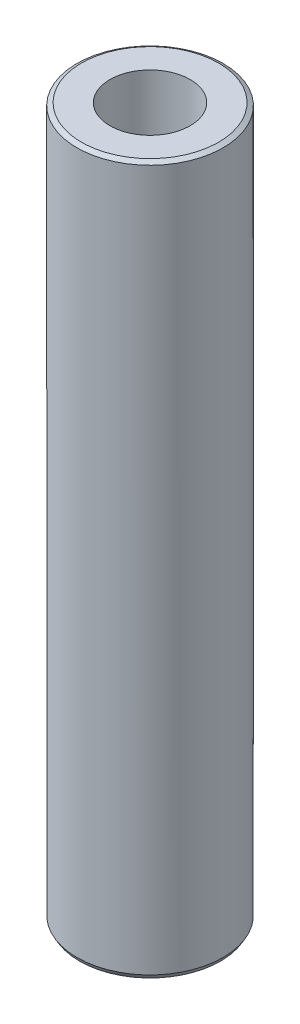
ISO-10303-21;
HEADER;
FILE_DESCRIPTION(('STEP AP214'),'2;1');
FILE_NAME('part.step','',(''),(''),'','','');
FILE_SCHEMA(('AUTOMOTIVE_DESIGN { 1 0 10303 214 1 1 1 1 }'));
ENDSEC;
DATA;
#1=APPLICATION_CONTEXT('core data for automotive mechanical design processes');
#2=APPLICATION_PROTOCOL_DEFINITION('international standard','automotive_design',2000,#1);
#3=PRODUCT_CONTEXT('',#1,'mechanical');
#4=PRODUCT('Part','Part','',(#3));
#5=PRODUCT_RELATED_PRODUCT_CATEGORY('part','',(#4));
#6=PRODUCT_DEFINITION_FORMATION('','',#4);
#7=PRODUCT_DEFINITION_CONTEXT('part definition',#1,'design');
#8=PRODUCT_DEFINITION('design','',#6,#7);
#9=PRODUCT_DEFINITION_SHAPE('','',#8);
#10=(LENGTH_UNIT() NAMED_UNIT(*) SI_UNIT(.MILLI.,.METRE.));
#11=(NAMED_UNIT(*) PLANE_ANGLE_UNIT() SI_UNIT($,.RADIAN.));
#12=(NAMED_UNIT(*) SI_UNIT($,.STERADIAN.) SOLID_ANGLE_UNIT());
#13=UNCERTAINTY_MEASURE_WITH_UNIT(LENGTH_MEASURE(1.E-05),#10,'distance_accuracy_value','');
#14=(GEOMETRIC_REPRESENTATION_CONTEXT(3) GLOBAL_UNCERTAINTY_ASSIGNED_CONTEXT((#13)) GLOBAL_UNIT_ASSIGNED_CONTEXT((#10,
#11,#12)) REPRESENTATION_CONTEXT('',''));
#15=CARTESIAN_POINT('',(0.,0.,0.));
#16=DIRECTION('',(0.,0.,1.));
#17=DIRECTION('',(1.,0.,0.));
#18=AXIS2_PLACEMENT_3D('',#15,#16,#17);
#19=CARTESIAN_POINT('',(0.,581.399340480142,0.));
#20=DIRECTION('',(0.,-1.,0.));
#21=DIRECTION('',(0.,0.,-1.));
#22=AXIS2_PLACEMENT_3D('',#19,#20,#21);
#23=CYLINDRICAL_SURFACE('',#22,60.);
#24=CARTESIAN_POINT('',(0.,579.271814325466,0.));
#25=DIRECTION('',(0.,1.,0.));
#26=DIRECTION('',(0.,0.,1.));
#27=AXIS2_PLACEMENT_3D('',#24,#25,#26);
#28=CIRCLE('',#27,60.);
#29=CARTESIAN_POINT('',(0.,579.271814325466,-60.));
#30=VERTEX_POINT('',#29);
#31=EDGE_CURVE('E50',#30,#30,#28,.F.);
#32=CARTESIAN_POINT('',(0.,3.68498339433121,0.));
#33=DIRECTION('',(0.,1.,0.));
#34=DIRECTION('',(0.,0.,1.));
#35=AXIS2_PLACEMENT_3D('',#32,#33,#34);
#36=CIRCLE('',#35,60.);
#37=CARTESIAN_POINT('',(0.,3.6849833943311,-60.));
#38=VERTEX_POINT('',#37);
#39=EDGE_CURVE('E51',#38,#38,#36,.T.);
#40=CARTESIAN_POINT('',(0.,579.271814325466,-60.));
#41=CARTESIAN_POINT('',(0.,573.276118169933,-60.));
#42=CARTESIAN_POINT('',(0.,567.280422014401,-60.));
#43=CARTESIAN_POINT('',(0.,555.289029703335,-60.));
#44=CARTESIAN_POINT('',(0.,549.293333547803,-60.));
#45=CARTESIAN_POINT('',(0.,537.301941236737,-60.));
#46=CARTESIAN_POINT('',(0.,531.306245081205,-60.));
#47=CARTESIAN_POINT('',(0.,519.314852770139,-60.));
#48=CARTESIAN_POINT('',(0.,513.319156614607,-60.));
#49=CARTESIAN_POINT('',(0.,501.327764303541,-60.));
#50=CARTESIAN_POINT('',(0.,495.332068148009,-60.));
#51=CARTESIAN_POINT('',(0.,483.340675836943,-60.));
#52=CARTESIAN_POINT('',(0.,477.344979681411,-60.));
#53=CARTESIAN_POINT('',(0.,465.353587370345,-60.));
#54=CARTESIAN_POINT('',(0.,459.357891214813,-60.));
#55=CARTESIAN_POINT('',(0.,447.366498903747,-60.));
#56=CARTESIAN_POINT('',(0.,441.370802748215,-60.));
#57=CARTESIAN_POINT('',(0.,429.379410437149,-60.));
#58=CARTESIAN_POINT('',(0.,423.383714281617,-60.));
#59=CARTESIAN_POINT('',(0.,411.392321970552,-60.));
#60=CARTESIAN_POINT('',(0.,405.396625815019,-60.));
#61=CARTESIAN_POINT('',(0.,393.405233503954,-60.));
#62=CARTESIAN_POINT('',(0.,387.409537348421,-60.));
#63=CARTESIAN_POINT('',(0.,375.418145037356,-60.));
#64=CARTESIAN_POINT('',(0.,369.422448881823,-60.));
#65=CARTESIAN_POINT('',(0.,357.431056570758,-60.));
#66=CARTESIAN_POINT('',(0.,351.435360415225,-60.));
#67=CARTESIAN_POINT('',(0.,339.44396810416,-60.));
#68=CARTESIAN_POINT('',(0.,333.448271948627,-60.));
#69=CARTESIAN_POINT('',(0.,321.456879637562,-60.));
#70=CARTESIAN_POINT('',(0.,315.461183482029,-60.));
#71=CARTESIAN_POINT('',(0.,303.469791170964,-60.));
#72=CARTESIAN_POINT('',(0.,297.474095015431,-60.));
#73=CARTESIAN_POINT('',(0.,285.482702704366,-60.));
#74=CARTESIAN_POINT('',(0.,279.487006548833,-60.));
#75=CARTESIAN_POINT('',(0.,267.495614237768,-60.));
#76=CARTESIAN_POINT('',(0.,261.499918082235,-60.));
#77=CARTESIAN_POINT('',(0.,249.50852577117,-60.));
#78=CARTESIAN_POINT('',(0.,243.512829615637,-60.));
#79=CARTESIAN_POINT('',(0.,231.521437304572,-60.));
#80=CARTESIAN_POINT('',(0.,225.525741149039,-60.));
#81=CARTESIAN_POINT('',(0.,213.534348837974,-60.));
#82=CARTESIAN_POINT('',(0.,207.538652682441,-60.));
#83=CARTESIAN_POINT('',(0.,195.547260371376,-60.));
#84=CARTESIAN_POINT('',(0.,189.551564215843,-60.));
#85=CARTESIAN_POINT('',(0.,177.560171904778,-60.));
#86=CARTESIAN_POINT('',(0.,171.564475749245,-60.));
#87=CARTESIAN_POINT('',(0.,159.57308343818,-60.));
#88=CARTESIAN_POINT('',(0.,153.577387282647,-60.));
#89=CARTESIAN_POINT('',(0.,141.585994971582,-60.));
#90=CARTESIAN_POINT('',(0.,135.590298816049,-60.));
#91=CARTESIAN_POINT('',(0.,123.598906504984,-60.));
#92=CARTESIAN_POINT('',(0.,117.603210349451,-60.));
#93=CARTESIAN_POINT('',(0.,105.611818038386,-60.));
#94=CARTESIAN_POINT('',(0.,99.6161218828535,-60.));
#95=CARTESIAN_POINT('',(0.,87.6247295717882,-60.));
#96=CARTESIAN_POINT('',(0.,81.6290334162556,-60.));
#97=CARTESIAN_POINT('',(0.,69.6376411051903,-60.));
#98=CARTESIAN_POINT('',(0.,63.6419449496576,-60.));
#99=CARTESIAN_POINT('',(0.,51.6505526385923,-60.));
#100=CARTESIAN_POINT('',(0.,45.6548564830596,-60.));
#101=CARTESIAN_POINT('',(0.,33.6634641719943,-60.));
#102=CARTESIAN_POINT('',(0.,27.6677680164617,-60.));
#103=CARTESIAN_POINT('',(0.,15.6763757053964,-60.));
#104=CARTESIAN_POINT('',(0.,9.68067954986377,-60.));
#105=CARTESIAN_POINT('',(0.,3.6849833943311,-60.));
#106=B_SPLINE_CURVE_WITH_KNOTS('',3,(#40,#41,#42,#43,#44,#45,#46,#47,#48,#49,#50,#51,#52,#53,
#54,#55,#56,#57,#58,#59,#60,#61,#62,#63,#64,#65,#66,#67,#68,#69,#70,#71,#72,#73,#74,#75,#76,#77,
#78,#79,#80,#81,#82,#83,#84,#85,#86,#87,#88,#89,#90,#91,#92,#93,#94,#95,#96,#97,#98,#99,#100,
#101,#102,#103,#104,#105),.UNSPECIFIED.,.F.,.F.,(4,2,2,2,2,2,2,2,2,2,2,2,2,2,2,2,2,2,2,2,2,2,2,
2,2,2,2,2,2,2,2,2,4),(0.,17.987088466598,35.9741769331959,53.961265399794,71.9483538663919,
89.9354423329899,107.922530799588,125.909619266186,143.896707732784,161.883796199382,
179.87088466598,197.857973132578,215.845061599176,233.832150065774,251.819238532372,
269.806326998969,287.793415465567,305.780503932165,323.767592398763,341.754680865361,
359.741769331959,377.728857798557,395.715946265155,413.703034731753,431.690123198351,
449.677211664949,467.664300131547,485.651388598145,503.638477064743,521.625565531341,
539.612653997939,557.599742464537,575.586830931135),.UNSPECIFIED.);
#107=EDGE_CURVE('BSEAM39',#30,#38,#106,.T.);
#108=ORIENTED_EDGE('',*,*,#31,.T.);
#109=ORIENTED_EDGE('',*,*,#39,.T.);
#110=ORIENTED_EDGE('',*,*,#107,.T.);
#111=ORIENTED_EDGE('',*,*,#107,.F.);
#112=EDGE_LOOP('',(#108,#110,#109,#111));
#113=FACE_BOUND('',#112,.T.);
#114=ADVANCED_FACE('F39',(#113),#23,.T.);
#115=CARTESIAN_POINT('',(0.,581.399340480142,0.));
#116=DIRECTION('',(0.,1.,0.));
#117=DIRECTION('',(0.,0.,1.));
#118=AXIS2_PLACEMENT_3D('',#115,#116,#117);
#119=PLANE('',#118);
#120=CARTESIAN_POINT('',(0.,581.399340480142,0.));
#121=DIRECTION('',(0.,1.,0.));
#122=DIRECTION('',(0.,0.,1.));
#123=AXIS2_PLACEMENT_3D('',#120,#121,#122);
#124=CIRCLE('',#123,56.3150166056702);
#125=CARTESIAN_POINT('',(0.,581.399340480142,-56.3150166056703));
#126=VERTEX_POINT('',#125);
#127=EDGE_CURVE('E54',#126,#126,#124,.T.);
#128=ORIENTED_EDGE('',*,*,#127,.T.);
#129=EDGE_LOOP('',(#128));
#130=FACE_BOUND('',#129,.T.);
#131=CARTESIAN_POINT('',(0.,581.399340480142,0.));
#132=DIRECTION('',(0.,1.,0.));
#133=DIRECTION('',(0.,0.,1.));
#134=AXIS2_PLACEMENT_3D('',#131,#132,#133);
#135=CIRCLE('',#134,32.9151020396335);
#136=CARTESIAN_POINT('',(0.,581.399340480141,-32.9151020396335));
#137=VERTEX_POINT('',#136);
#138=EDGE_CURVE('E58',#137,#137,#135,.T.);
#139=ORIENTED_EDGE('',*,*,#138,.F.);
#140=EDGE_LOOP('',(#139));
#141=FACE_BOUND('',#140,.T.);
#142=ADVANCED_FACE('F69',(#130,#141),#119,.T.);
#143=CARTESIAN_POINT('',(0.,0.,0.));
#144=DIRECTION('',(0.,1.,0.));
#145=DIRECTION('',(0.,0.,1.));
#146=AXIS2_PLACEMENT_3D('',#143,#144,#145);
#147=PLANE('',#146);
#148=CARTESIAN_POINT('',(0.,0.,0.));
#149=DIRECTION('',(0.,1.,0.));
#150=DIRECTION('',(0.,0.,1.));
#151=AXIS2_PLACEMENT_3D('',#148,#149,#150);
#152=CIRCLE('',#151,57.8724738453236);
#153=CARTESIAN_POINT('',(0.,0.,57.8724738453236));
#154=VERTEX_POINT('',#153);
#155=EDGE_CURVE('E10',#154,#154,#152,.F.);
#156=ORIENTED_EDGE('',*,*,#155,.T.);
#157=EDGE_LOOP('',(#156));
#158=FACE_BOUND('',#157,.T.);
#159=CARTESIAN_POINT('',(0.,0.,0.));
#160=DIRECTION('',(0.,1.,0.));
#161=DIRECTION('',(0.,0.,1.));
#162=AXIS2_PLACEMENT_3D('',#159,#160,#161);
#163=CIRCLE('',#162,32.9151020396335);
#164=CARTESIAN_POINT('',(0.,0.,-32.9151020396335));
#165=VERTEX_POINT('',#164);
#166=EDGE_CURVE('E63',#165,#165,#163,.T.);
#167=ORIENTED_EDGE('',*,*,#166,.T.);
#168=EDGE_LOOP('',(#167));
#169=FACE_BOUND('',#168,.T.);
#170=ADVANCED_FACE('F75',(#158,#169),#147,.F.);
#171=CARTESIAN_POINT('',(0.,581.399340480142,0.));
#172=DIRECTION('',(0.,-1.,0.));
#173=DIRECTION('',(0.,0.,-1.));
#174=AXIS2_PLACEMENT_3D('',#171,#172,#173);
#175=CYLINDRICAL_SURFACE('',#174,32.9151020396335);
#176=CARTESIAN_POINT('',(0.,581.399340480141,-32.9151020396335));
#177=CARTESIAN_POINT('',(0.,575.34309735014,-32.9151020396335));
#178=CARTESIAN_POINT('',(0.,569.286854220138,-32.9151020396335));
#179=CARTESIAN_POINT('',(0.,557.174367960136,-32.9151020396335));
#180=CARTESIAN_POINT('',(0.,551.118124830134,-32.9151020396335));
#181=CARTESIAN_POINT('',(0.,539.005638570131,-32.9151020396335));
#182=CARTESIAN_POINT('',(0.,532.94939544013,-32.9151020396335));
#183=CARTESIAN_POINT('',(0.,520.836909180127,-32.9151020396335));
#184=CARTESIAN_POINT('',(0.,514.780666050125,-32.9151020396335));
#185=CARTESIAN_POINT('',(0.,502.668179790122,-32.9151020396335));
#186=CARTESIAN_POINT('',(0.,496.611936660121,-32.9151020396335));
#187=CARTESIAN_POINT('',(0.,484.499450400118,-32.9151020396335));
#188=CARTESIAN_POINT('',(0.,478.443207270116,-32.9151020396335));
#189=CARTESIAN_POINT('',(0.,466.330721010113,-32.9151020396335));
#190=CARTESIAN_POINT('',(0.,460.274477880112,-32.9151020396335));
#191=CARTESIAN_POINT('',(0.,448.161991620109,-32.9151020396335));
#192=CARTESIAN_POINT('',(0.,442.105748490108,-32.9151020396335));
#193=CARTESIAN_POINT('',(0.,429.993262230105,-32.9151020396335));
#194=CARTESIAN_POINT('',(0.,423.937019100103,-32.9151020396335));
#195=CARTESIAN_POINT('',(0.,411.8245328401,-32.9151020396335));
#196=CARTESIAN_POINT('',(0.,405.768289710099,-32.9151020396335));
#197=CARTESIAN_POINT('',(0.,393.655803450096,-32.9151020396335));
#198=CARTESIAN_POINT('',(0.,387.599560320094,-32.9151020396335));
#199=CARTESIAN_POINT('',(0.,375.487074060091,-32.9151020396335));
#200=CARTESIAN_POINT('',(0.,369.43083093009,-32.9151020396335));
#201=CARTESIAN_POINT('',(0.,357.318344670087,-32.9151020396335));
#202=CARTESIAN_POINT('',(0.,351.262101540085,-32.9151020396335));
#203=CARTESIAN_POINT('',(0.,339.149615280083,-32.9151020396335));
#204=CARTESIAN_POINT('',(0.,333.093372150081,-32.9151020396335));
#205=CARTESIAN_POINT('',(0.,320.980885890078,-32.9151020396335));
#206=CARTESIAN_POINT('',(0.,314.924642760077,-32.9151020396335));
#207=CARTESIAN_POINT('',(0.,302.812156500074,-32.9151020396335));
#208=CARTESIAN_POINT('',(0.,296.755913370072,-32.9151020396335));
#209=CARTESIAN_POINT('',(0.,284.643427110069,-32.9151020396335));
#210=CARTESIAN_POINT('',(0.,278.587183980068,-32.9151020396335));
#211=CARTESIAN_POINT('',(0.,266.474697720065,-32.9151020396335));
#212=CARTESIAN_POINT('',(0.,260.418454590063,-32.9151020396335));
#213=CARTESIAN_POINT('',(0.,248.30596833006,-32.9151020396335));
#214=CARTESIAN_POINT('',(0.,242.249725200059,-32.9151020396335));
#215=CARTESIAN_POINT('',(0.,230.137238940056,-32.9151020396335));
#216=CARTESIAN_POINT('',(0.,224.080995810055,-32.9151020396335));
#217=CARTESIAN_POINT('',(0.,211.968509550052,-32.9151020396335));
#218=CARTESIAN_POINT('',(0.,205.91226642005,-32.9151020396335));
#219=CARTESIAN_POINT('',(0.,193.799780160047,-32.9151020396335));
#220=CARTESIAN_POINT('',(0.,187.743537030046,-32.9151020396335));
#221=CARTESIAN_POINT('',(0.,175.631050770043,-32.9151020396335));
#222=CARTESIAN_POINT('',(0.,169.574807640041,-32.9151020396335));
#223=CARTESIAN_POINT('',(0.,157.462321380038,-32.9151020396335));
#224=CARTESIAN_POINT('',(0.,151.406078250037,-32.9151020396335));
#225=CARTESIAN_POINT('',(0.,139.293591990034,-32.9151020396335));
#226=CARTESIAN_POINT('',(0.,133.237348860032,-32.9151020396335));
#227=CARTESIAN_POINT('',(0.,121.124862600029,-32.9151020396335));
#228=CARTESIAN_POINT('',(0.,115.068619470028,-32.9151020396335));
#229=CARTESIAN_POINT('',(0.,102.956133210025,-32.9151020396335));
#230=CARTESIAN_POINT('',(0.,96.8998900800236,-32.9151020396335));
#231=CARTESIAN_POINT('',(0.,84.7874038200206,-32.9151020396335));
#232=CARTESIAN_POINT('',(0.,78.7311606900191,-32.9151020396335));
#233=CARTESIAN_POINT('',(0.,66.6186744300162,-32.9151020396335));
#234=CARTESIAN_POINT('',(0.,60.5624313000147,-32.9151020396335));
#235=CARTESIAN_POINT('',(0.,48.4499450400118,-32.9151020396335));
#236=CARTESIAN_POINT('',(0.,42.3937019100103,-32.9151020396335));
#237=CARTESIAN_POINT('',(0.,30.2812156500074,-32.9151020396335));
#238=CARTESIAN_POINT('',(0.,24.2249725200059,-32.9151020396335));
#239=CARTESIAN_POINT('',(0.,12.112486260003,-32.9151020396335));
#240=CARTESIAN_POINT('',(0.,6.0562431300015,-32.9151020396335));
#241=CARTESIAN_POINT('',(0.,0.,-32.9151020396335));
#242=B_SPLINE_CURVE_WITH_KNOTS('',3,(#176,#177,#178,#179,#180,#181,#182,#183,#184,#185,#186,
#187,#188,#189,#190,#191,#192,#193,#194,#195,#196,#197,#198,#199,#200,#201,#202,#203,#204,#205,
#206,#207,#208,#209,#210,#211,#212,#213,#214,#215,#216,#217,#218,#219,#220,#221,#222,#223,#224,
#225,#226,#227,#228,#229,#230,#231,#232,#233,#234,#235,#236,#237,#238,#239,#240,#241),
.UNSPECIFIED.,.F.,.F.,(4,2,2,2,2,2,2,2,2,2,2,2,2,2,2,2,2,2,2,2,2,2,2,2,2,2,2,2,2,2,2,2,4),(0.,
18.1687293900044,36.3374587800088,54.5061881700132,72.6749175600176,90.8436469500221,
109.012376340026,127.181105730031,145.349835120035,163.51856451004,181.687293900044,
199.856023290049,218.024752680053,236.193482070057,254.362211460062,272.530940850066,
290.699670240071,308.868399630075,327.037129020079,345.205858410084,363.374587800088,
381.543317190093,399.712046580097,417.880775970102,436.049505360106,454.21823475011,
472.386964140115,490.555693530119,508.724422920124,526.893152310128,545.061881700133,
563.230611090137,581.399340480141),.UNSPECIFIED.);
#243=EDGE_CURVE('BSEAM70',#137,#165,#242,.T.);
#244=ORIENTED_EDGE('',*,*,#138,.T.);
#245=ORIENTED_EDGE('',*,*,#166,.F.);
#246=ORIENTED_EDGE('',*,*,#243,.T.);
#247=ORIENTED_EDGE('',*,*,#243,.F.);
#248=EDGE_LOOP('',(#244,#246,#245,#247));
#249=FACE_BOUND('',#248,.T.);
#250=ADVANCED_FACE('F70',(#249),#175,.F.);
#251=CARTESIAN_POINT('',(0.,581.399340480142,0.));
#252=DIRECTION('',(0.,-1.,0.));
#253=DIRECTION('',(0.,0.,-1.));
#254=AXIS2_PLACEMENT_3D('',#251,#252,#253);
#255=CONICAL_SURFACE('',#254,56.3150166056702,1.0471975511966);
#256=CARTESIAN_POINT('',(0.,579.271814325466,-60.0000000000001));
#257=CARTESIAN_POINT('',(0.,579.293976056244,-59.9616147563091));
#258=CARTESIAN_POINT('',(0.,579.316137787022,-59.9232295126182));
#259=CARTESIAN_POINT('',(0.,579.360461248577,-59.8464590252363));
#260=CARTESIAN_POINT('',(0.,579.382622979355,-59.8080737815454));
#261=CARTESIAN_POINT('',(0.,579.426946440911,-59.7313032941635));
#262=CARTESIAN_POINT('',(0.,579.449108171689,-59.6929180504726));
#263=CARTESIAN_POINT('',(0.,579.493431633245,-59.6161475630907));
#264=CARTESIAN_POINT('',(0.,579.515593364022,-59.5777623193998));
#265=CARTESIAN_POINT('',(0.,579.559916825578,-59.5009918320179));
#266=CARTESIAN_POINT('',(0.,579.582078556356,-59.462606588327));
#267=CARTESIAN_POINT('',(0.,579.626402017912,-59.3858361009451));
#268=CARTESIAN_POINT('',(0.,579.64856374869,-59.3474508572542));
#269=CARTESIAN_POINT('',(0.,579.692887210245,-59.2706803698723));
#270=CARTESIAN_POINT('',(0.,579.715048941023,-59.2322951261814));
#271=CARTESIAN_POINT('',(0.,579.759372402579,-59.1555246387995));
#272=CARTESIAN_POINT('',(0.,579.781534133357,-59.1171393951086));
#273=CARTESIAN_POINT('',(0.,579.825857594913,-59.0403689077267));
#274=CARTESIAN_POINT('',(0.,579.848019325691,-59.0019836640357));
#275=CARTESIAN_POINT('',(0.,579.892342787246,-58.9252131766539));
#276=CARTESIAN_POINT('',(0.,579.914504518024,-58.886827932963));
#277=CARTESIAN_POINT('',(0.,579.95882797958,-58.8100574455811));
#278=CARTESIAN_POINT('',(0.,579.980989710358,-58.7716722018901));
#279=CARTESIAN_POINT('',(0.,580.025313171913,-58.6949017145083));
#280=CARTESIAN_POINT('',(0.,580.047474902691,-58.6565164708173));
#281=CARTESIAN_POINT('',(0.,580.091798364247,-58.5797459834355));
#282=CARTESIAN_POINT('',(0.,580.113960095025,-58.5413607397445));
#283=CARTESIAN_POINT('',(0.,580.158283556581,-58.4645902523627));
#284=CARTESIAN_POINT('',(0.,580.180445287359,-58.4262050086717));
#285=CARTESIAN_POINT('',(0.,580.224768748914,-58.3494345212898));
#286=CARTESIAN_POINT('',(0.,580.246930479692,-58.3110492775989));
#287=CARTESIAN_POINT('',(0.,580.291253941248,-58.2342787902171));
#288=CARTESIAN_POINT('',(0.,580.313415672026,-58.1958935465261));
#289=CARTESIAN_POINT('',(0.,580.357739133582,-58.1191230591442));
#290=CARTESIAN_POINT('',(0.,580.379900864359,-58.0807378154533));
#291=CARTESIAN_POINT('',(0.,580.424224325915,-58.0039673280714));
#292=CARTESIAN_POINT('',(0.,580.446386056693,-57.9655820843805));
#293=CARTESIAN_POINT('',(0.,580.490709518249,-57.8888115969986));
#294=CARTESIAN_POINT('',(0.,580.512871249027,-57.8504263533077));
#295=CARTESIAN_POINT('',(0.,580.557194710582,-57.7736558659258));
#296=CARTESIAN_POINT('',(0.,580.57935644136,-57.7352706222349));
#297=CARTESIAN_POINT('',(0.,580.623679902916,-57.658500134853));
#298=CARTESIAN_POINT('',(0.,580.645841633694,-57.6201148911621));
#299=CARTESIAN_POINT('',(0.,580.69016509525,-57.5433444037802));
#300=CARTESIAN_POINT('',(0.,580.712326826027,-57.5049591600893));
#301=CARTESIAN_POINT('',(0.,580.756650287583,-57.4281886727074));
#302=CARTESIAN_POINT('',(0.,580.778812018361,-57.3898034290165));
#303=CARTESIAN_POINT('',(0.,580.823135479917,-57.3130329416346));
#304=CARTESIAN_POINT('',(0.,580.845297210695,-57.2746476979437));
#305=CARTESIAN_POINT('',(0.,580.88962067225,-57.1978772105618));
#306=CARTESIAN_POINT('',(0.,580.911782403028,-57.1594919668708));
#307=CARTESIAN_POINT('',(0.,580.956105864584,-57.082721479489));
#308=CARTESIAN_POINT('',(0.,580.978267595362,-57.044336235798));
#309=CARTESIAN_POINT('',(0.,581.022591056918,-56.9675657484162));
#310=CARTESIAN_POINT('',(0.,581.044752787696,-56.9291805047252));
#311=CARTESIAN_POINT('',(0.,581.089076249251,-56.8524100173433));
#312=CARTESIAN_POINT('',(0.,581.111237980029,-56.8140247736524));
#313=CARTESIAN_POINT('',(0.,581.155561441585,-56.7372542862706));
#314=CARTESIAN_POINT('',(0.,581.177723172363,-56.6988690425796));
#315=CARTESIAN_POINT('',(0.,581.222046633918,-56.6220985551978));
#316=CARTESIAN_POINT('',(0.,581.244208364696,-56.5837133115068));
#317=CARTESIAN_POINT('',(0.,581.288531826252,-56.5069428241249));
#318=CARTESIAN_POINT('',(0.,581.31069355703,-56.468557580434));
#319=CARTESIAN_POINT('',(0.,581.355017018586,-56.3917870930521));
#320=CARTESIAN_POINT('',(0.,581.377178749364,-56.3534018493612));
#321=CARTESIAN_POINT('',(0.,581.399340480142,-56.3150166056703));
#322=B_SPLINE_CURVE_WITH_KNOTS('',3,(#256,#257,#258,#259,#260,#261,#262,#263,#264,#265,#266,
#267,#268,#269,#270,#271,#272,#273,#274,#275,#276,#277,#278,#279,#280,#281,#282,#283,#284,#285,
#286,#287,#288,#289,#290,#291,#292,#293,#294,#295,#296,#297,#298,#299,#300,#301,#302,#303,#304,
#305,#306,#307,#308,#309,#310,#311,#312,#313,#314,#315,#316,#317,#318,#319,#320,#321),
.UNSPECIFIED.,.F.,.F.,(4,2,2,2,2,2,2,2,2,2,2,2,2,2,2,2,2,2,2,2,2,2,2,2,2,2,2,2,2,2,2,2,4),(0.,
0.13297038466719,0.265940769334441,0.398911154001631,0.531881538668876,0.664851923336128,
0.797822308003318,0.930792692670563,1.06376307733781,1.196733462005,1.32970384667225,
1.46267423133945,1.59564461600669,1.72861500067394,1.86158538534113,1.99455577000838,
2.12752615467562,2.26049653934281,2.39346692401006,2.52643730867725,2.6594076933445,
2.79237807801175,2.92534846267894,3.05831884734618,3.19128923201344,3.32425961668063,
3.45723000134787,3.59020038601507,3.72317077068231,3.85614115534956,3.98911154001675,
4.122081924684,4.25505230935124),.UNSPECIFIED.);
#323=EDGE_CURVE('BSEAM81',#30,#126,#322,.T.);
#324=ORIENTED_EDGE('',*,*,#31,.F.);
#325=ORIENTED_EDGE('',*,*,#127,.F.);
#326=ORIENTED_EDGE('',*,*,#323,.T.);
#327=ORIENTED_EDGE('',*,*,#323,.F.);
#328=EDGE_LOOP('',(#324,#326,#325,#327));
#329=FACE_BOUND('',#328,.T.);
#330=ADVANCED_FACE('F81',(#329),#255,.T.);
#331=CARTESIAN_POINT('',(0.,3.68498339433121,0.));
#332=DIRECTION('',(0.,1.,0.));
#333=DIRECTION('',(0.,0.,1.));
#334=AXIS2_PLACEMENT_3D('',#331,#332,#333);
#335=CONICAL_SURFACE('',#334,60.,0.523598775598297);
#336=ORIENTED_EDGE('',*,*,#155,.F.);
#337=EDGE_LOOP('',(#336));
#338=FACE_BOUND('',#337,.T.);
#339=ORIENTED_EDGE('',*,*,#39,.F.);
#340=EDGE_LOOP('',(#339));
#341=FACE_BOUND('',#340,.T.);
#342=ADVANCED_FACE('F45',(#338,#341),#335,.T.);
#343=CLOSED_SHELL('',(#114,#142,#170,#250,#330,#342));
#344=MANIFOLD_SOLID_BREP('B2',#343);
#345=ADVANCED_BREP_SHAPE_REPRESENTATION('',(#18,#344),#14);
#346=SHAPE_DEFINITION_REPRESENTATION(#9,#345);
ENDSEC;
END-ISO-10303-21;
